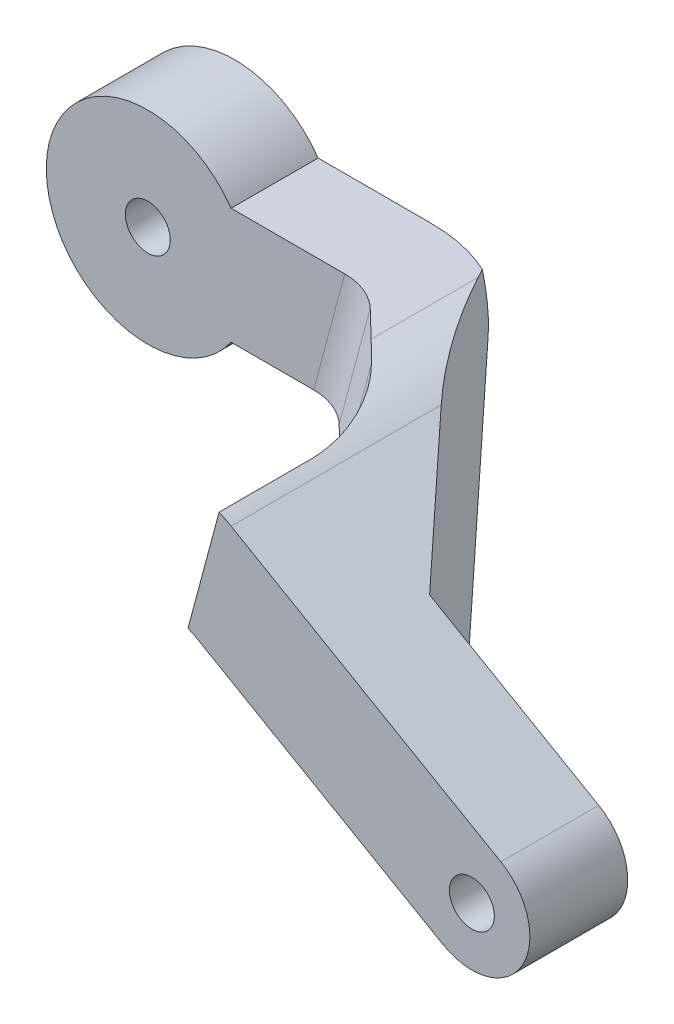
ISO-10303-21;
HEADER;
FILE_DESCRIPTION(('STEP AP214'),'2;1');
FILE_NAME('part.step','',(''),(''),'','','');
FILE_SCHEMA(('AUTOMOTIVE_DESIGN { 1 0 10303 214 1 1 1 1 }'));
ENDSEC;
DATA;
#1=APPLICATION_CONTEXT('core data for automotive mechanical design processes');
#2=APPLICATION_PROTOCOL_DEFINITION('international standard','automotive_design',2000,#1);
#3=PRODUCT_CONTEXT('',#1,'mechanical');
#4=PRODUCT('Part','Part','',(#3));
#5=PRODUCT_RELATED_PRODUCT_CATEGORY('part','',(#4));
#6=PRODUCT_DEFINITION_FORMATION('','',#4);
#7=PRODUCT_DEFINITION_CONTEXT('part definition',#1,'design');
#8=PRODUCT_DEFINITION('design','',#6,#7);
#9=PRODUCT_DEFINITION_SHAPE('','',#8);
#10=(LENGTH_UNIT() NAMED_UNIT(*) SI_UNIT(.MILLI.,.METRE.));
#11=(NAMED_UNIT(*) PLANE_ANGLE_UNIT() SI_UNIT($,.RADIAN.));
#12=(NAMED_UNIT(*) SI_UNIT($,.STERADIAN.) SOLID_ANGLE_UNIT());
#13=UNCERTAINTY_MEASURE_WITH_UNIT(LENGTH_MEASURE(1.E-05),#10,'distance_accuracy_value','');
#14=(GEOMETRIC_REPRESENTATION_CONTEXT(3) GLOBAL_UNCERTAINTY_ASSIGNED_CONTEXT((#13)) GLOBAL_UNIT_ASSIGNED_CONTEXT((#10,
#11,#12)) REPRESENTATION_CONTEXT('',''));
#15=CARTESIAN_POINT('',(0.,0.,0.));
#16=DIRECTION('',(0.,0.,1.));
#17=DIRECTION('',(1.,0.,0.));
#18=AXIS2_PLACEMENT_3D('',#15,#16,#17);
#19=CARTESIAN_POINT('',(0.,0.,-25.35));
#20=DIRECTION('',(0.,0.,1.));
#21=DIRECTION('',(1.,0.,0.));
#22=AXIS2_PLACEMENT_3D('',#19,#20,#21);
#23=PLANE('',#22);
#24=CARTESIAN_POINT('',(40.,-11.5470053837925,-25.35));
#25=DIRECTION('',(0.,0.,1.));
#26=DIRECTION('',(1.,0.,0.));
#27=AXIS2_PLACEMENT_3D('',#24,#25,#26);
#28=CIRCLE('',#27,1.55);
#29=CARTESIAN_POINT('',(41.55,-11.5470053837925,-25.35));
#30=VERTEX_POINT('',#29);
#31=EDGE_CURVE('E181',#30,#30,#28,.F.);
#32=ORIENTED_EDGE('',*,*,#31,.T.);
#33=EDGE_LOOP('',(#32));
#34=FACE_BOUND('',#33,.T.);
#35=DIRECTION('',(-0.866025403784438,0.500000000000001,0.));
#36=VECTOR('',#35,1.);
#37=CARTESIAN_POINT('',(7.00000000000003,12.1243556529822,-25.35));
#38=LINE('',#37,#36);
#39=CARTESIAN_POINT('',(42.,-8.0829037686548,-25.35));
#40=VERTEX_POINT('',#39);
#41=CARTESIAN_POINT('',(23.3923048454133,2.66025403784438,-25.35));
#42=VERTEX_POINT('',#41);
#43=EDGE_CURVE('E172',#40,#42,#38,.T.);
#44=ORIENTED_EDGE('',*,*,#43,.T.);
#45=CARTESIAN_POINT('',(18.3923048454133,-6.,-25.35));
#46=DIRECTION('',(0.,0.,1.));
#47=DIRECTION('',(1.,0.,0.));
#48=AXIS2_PLACEMENT_3D('',#45,#46,#47);
#49=CIRCLE('',#48,10.);
#50=CARTESIAN_POINT('',(22.5678321839119,3.08652691876553,-25.35));
#51=VERTEX_POINT('',#50);
#52=EDGE_CURVE('E218',#42,#51,#49,.T.);
#53=ORIENTED_EDGE('',*,*,#52,.T.);
#54=DIRECTION('',(-0.258819045102521,-0.965925826289068,0.));
#55=VECTOR('',#54,1.);
#56=CARTESIAN_POINT('',(17.8819508450437,-14.4014203161296,-25.35));
#57=LINE('',#56,#55);
#58=CARTESIAN_POINT('',(20.4242386444629,-4.91347308123447,-25.35));
#59=VERTEX_POINT('',#58);
#60=EDGE_CURVE('E184',#51,#59,#57,.T.);
#61=ORIENTED_EDGE('',*,*,#60,.T.);
#62=CARTESIAN_POINT('',(16.2487113059643,-14.,-25.35));
#63=DIRECTION('',(0.,0.,1.));
#64=DIRECTION('',(1.,0.,0.));
#65=AXIS2_PLACEMENT_3D('',#62,#63,#64);
#66=CIRCLE('',#65,10.);
#67=CARTESIAN_POINT('',(21.2487113059643,-5.33974596215562,-25.35));
#68=VERTEX_POINT('',#67);
#69=EDGE_CURVE('E235',#59,#68,#66,.F.);
#70=ORIENTED_EDGE('',*,*,#69,.T.);
#71=DIRECTION('',(-0.866025403784438,0.500000000000001,0.));
#72=VECTOR('',#71,1.);
#73=CARTESIAN_POINT('',(3.00000000000002,5.19615242270665,-25.35));
#74=LINE('',#73,#72);
#75=CARTESIAN_POINT('',(38.,-15.0111069989303,-25.35));
#76=VERTEX_POINT('',#75);
#77=EDGE_CURVE('E174',#76,#68,#74,.T.);
#78=ORIENTED_EDGE('',*,*,#77,.F.);
#79=CARTESIAN_POINT('',(40.,-11.5470053837925,-25.35));
#80=DIRECTION('',(0.,0.,1.));
#81=DIRECTION('',(1.,0.,0.));
#82=AXIS2_PLACEMENT_3D('',#79,#80,#81);
#83=CIRCLE('',#82,4.);
#84=EDGE_CURVE('E162',#40,#76,#83,.F.);
#85=ORIENTED_EDGE('',*,*,#84,.F.);
#86=EDGE_LOOP('',(#44,#53,#61,#70,#78,#85));
#87=FACE_BOUND('',#86,.T.);
#88=ADVANCED_FACE('F40',(#34,#87),#23,.T.);
#89=CARTESIAN_POINT('',(40.,-11.5470053837925,-49.));
#90=DIRECTION('',(0.,0.,1.));
#91=DIRECTION('',(1.,0.,0.));
#92=AXIS2_PLACEMENT_3D('',#89,#90,#91);
#93=CYLINDRICAL_SURFACE('',#92,4.);
#94=DIRECTION('',(0.,0.,1.));
#95=VECTOR('',#94,1.);
#96=CARTESIAN_POINT('',(42.,-8.0829037686548,-49.));
#97=LINE('',#96,#95);
#98=CARTESIAN_POINT('',(42.,-8.0829037686548,-32.1));
#99=VERTEX_POINT('',#98);
#100=EDGE_CURVE('E158',#99,#40,#97,.T.);
#101=ORIENTED_EDGE('',*,*,#100,.T.);
#102=ORIENTED_EDGE('',*,*,#84,.T.);
#103=DIRECTION('',(0.,0.,1.));
#104=VECTOR('',#103,1.);
#105=CARTESIAN_POINT('',(38.,-15.0111069989303,-49.));
#106=LINE('',#105,#104);
#107=CARTESIAN_POINT('',(38.,-15.0111069989303,-32.1));
#108=VERTEX_POINT('',#107);
#109=EDGE_CURVE('E167',#108,#76,#106,.T.);
#110=ORIENTED_EDGE('',*,*,#109,.F.);
#111=CARTESIAN_POINT('',(40.,-11.5470053837925,-32.1));
#112=DIRECTION('',(0.,0.,1.));
#113=DIRECTION('',(1.,0.,0.));
#114=AXIS2_PLACEMENT_3D('',#111,#112,#113);
#115=CIRCLE('',#114,4.);
#116=EDGE_CURVE('E164',#99,#108,#115,.F.);
#117=ORIENTED_EDGE('',*,*,#116,.F.);
#118=EDGE_LOOP('',(#101,#102,#110,#117));
#119=FACE_BOUND('',#118,.T.);
#120=ADVANCED_FACE('F160',(#119),#93,.T.);
#121=CARTESIAN_POINT('',(7.00000000000003,12.1243556529822,-49.));
#122=DIRECTION('',(-0.500000000000001,-0.866025403784438,0.));
#123=DIRECTION('',(0.866025403784438,-0.500000000000001,0.));
#124=AXIS2_PLACEMENT_3D('',#121,#122,#123);
#125=PLANE('',#124);
#126=DIRECTION('',(-0.622892752510496,0.359627298338203,-0.694746590606866));
#127=VECTOR('',#126,1.);
#128=CARTESIAN_POINT('',(10.9496274143465,9.84403720211049,-53.7215187518741));
#129=LINE('',#128,#127);
#130=CARTESIAN_POINT('',(30.3349507982985,-1.34808447194216,-32.1));
#131=VERTEX_POINT('',#130);
#132=CARTESIAN_POINT('',(23.3923048454133,2.66025403784438,-39.8435153742236));
#133=VERTEX_POINT('',#132);
#134=EDGE_CURVE('E201',#131,#133,#129,.T.);
#135=ORIENTED_EDGE('',*,*,#134,.T.);
#136=DIRECTION('',(0.,0.,1.));
#137=VECTOR('',#136,1.);
#138=CARTESIAN_POINT('',(23.3923048454133,2.66025403784438,-49.));
#139=LINE('',#138,#137);
#140=EDGE_CURVE('E180',#133,#42,#139,.T.);
#141=ORIENTED_EDGE('',*,*,#140,.T.);
#142=ORIENTED_EDGE('',*,*,#43,.F.);
#143=ORIENTED_EDGE('',*,*,#100,.F.);
#144=DIRECTION('',(-0.866025403784438,0.500000000000001,0.));
#145=VECTOR('',#144,1.);
#146=CARTESIAN_POINT('',(7.00000000000003,12.1243556529821,-32.1));
#147=LINE('',#146,#145);
#148=EDGE_CURVE('E383',#99,#131,#147,.T.);
#149=ORIENTED_EDGE('',*,*,#148,.T.);
#150=EDGE_LOOP('',(#135,#141,#142,#143,#149));
#151=FACE_BOUND('',#150,.T.);
#152=ADVANCED_FACE('F178',(#151),#125,.F.);
#153=CARTESIAN_POINT('',(3.00000000000002,5.19615242270665,-49.));
#154=DIRECTION('',(-0.500000000000001,-0.866025403784438,0.));
#155=DIRECTION('',(0.866025403784438,-0.500000000000001,0.));
#156=AXIS2_PLACEMENT_3D('',#153,#154,#155);
#157=PLANE('',#156);
#158=ORIENTED_EDGE('',*,*,#77,.T.);
#159=DIRECTION('',(0.,0.,1.));
#160=VECTOR('',#159,1.);
#161=CARTESIAN_POINT('',(21.2487113059643,-5.33974596215562,-45.9071014330082));
#162=LINE('',#161,#160);
#163=CARTESIAN_POINT('',(21.2487113059643,-5.33974596215562,-43.318910981983));
#164=VERTEX_POINT('',#163);
#165=EDGE_CURVE('E215',#68,#164,#162,.F.);
#166=ORIENTED_EDGE('',*,*,#165,.T.);
#167=DIRECTION('',(-0.622892752510496,0.359627298338203,-0.694746590606866));
#168=VECTOR('',#167,1.);
#169=CARTESIAN_POINT('',(9.34965090661684,1.53017976251126,-56.5905883462697));
#170=LINE('',#169,#168);
#171=CARTESIAN_POINT('',(31.3073117168471,-11.1470816170497,-32.1));
#172=VERTEX_POINT('',#171);
#173=EDGE_CURVE('E385',#172,#164,#170,.T.);
#174=ORIENTED_EDGE('',*,*,#173,.F.);
#175=DIRECTION('',(-0.866025403784438,0.500000000000001,0.));
#176=VECTOR('',#175,1.);
#177=CARTESIAN_POINT('',(3.00000000000002,5.19615242270664,-32.1));
#178=LINE('',#177,#176);
#179=EDGE_CURVE('E381',#108,#172,#178,.T.);
#180=ORIENTED_EDGE('',*,*,#179,.F.);
#181=ORIENTED_EDGE('',*,*,#109,.T.);
#182=EDGE_LOOP('',(#158,#166,#174,#180,#181));
#183=FACE_BOUND('',#182,.T.);
#184=ADVANCED_FACE('F303',(#183),#157,.T.);
#185=CARTESIAN_POINT('',(40.,-11.5470053837925,-49.));
#186=DIRECTION('',(0.,0.,1.));
#187=DIRECTION('',(1.,0.,0.));
#188=AXIS2_PLACEMENT_3D('',#185,#186,#187);
#189=CYLINDRICAL_SURFACE('',#188,1.55);
#190=CARTESIAN_POINT('',(40.,-11.5470053837925,-32.1));
#191=DIRECTION('',(0.,0.,1.));
#192=DIRECTION('',(1.,0.,0.));
#193=AXIS2_PLACEMENT_3D('',#190,#191,#192);
#194=CIRCLE('',#193,1.55);
#195=CARTESIAN_POINT('',(41.55,-11.5470053837925,-32.1));
#196=VERTEX_POINT('',#195);
#197=EDGE_CURVE('E378',#196,#196,#194,.F.);
#198=ORIENTED_EDGE('',*,*,#197,.T.);
#199=EDGE_LOOP('',(#198));
#200=FACE_BOUND('',#199,.T.);
#201=ORIENTED_EDGE('',*,*,#31,.F.);
#202=EDGE_LOOP('',(#201));
#203=FACE_BOUND('',#202,.T.);
#204=ADVANCED_FACE('F312',(#200,#203),#189,.F.);
#205=CARTESIAN_POINT('',(17.8819508450437,-14.4014203161296,-35.740336584551));
#206=DIRECTION('',(0.965925826289068,-0.258819045102521,0.));
#207=DIRECTION('',(0.258819045102521,0.965925826289068,0.));
#208=AXIS2_PLACEMENT_3D('',#205,#206,#207);
#209=PLANE('',#208);
#210=DIRECTION('',(0.,0.,1.));
#211=VECTOR('',#210,1.);
#212=CARTESIAN_POINT('',(22.5678321839119,3.08652691876553,-25.35));
#213=LINE('',#212,#211);
#214=CARTESIAN_POINT('',(22.5678321839119,3.08652691876553,-31.59820096082));
#215=VERTEX_POINT('',#214);
#216=EDGE_CURVE('E220',#51,#215,#213,.F.);
#217=ORIENTED_EDGE('',*,*,#216,.T.);
#218=DIRECTION('',(0.258819045102521,0.965925826289068,0.));
#219=VECTOR('',#218,1.);
#220=CARTESIAN_POINT('',(20.4242386444629,-4.91347308123447,-31.59820096082));
#221=LINE('',#220,#219);
#222=CARTESIAN_POINT('',(20.4242386444629,-4.91347308123447,-31.59820096082));
#223=VERTEX_POINT('',#222);
#224=EDGE_CURVE('E330',#215,#223,#221,.F.);
#225=ORIENTED_EDGE('',*,*,#224,.T.);
#226=DIRECTION('',(0.,0.,-1.));
#227=VECTOR('',#226,1.);
#228=CARTESIAN_POINT('',(20.4242386444629,-4.91347308123447,-35.740336584551));
#229=LINE('',#228,#227);
#230=EDGE_CURVE('E233',#223,#59,#229,.F.);
#231=ORIENTED_EDGE('',*,*,#230,.T.);
#232=ORIENTED_EDGE('',*,*,#60,.F.);
#233=EDGE_LOOP('',(#217,#225,#231,#232));
#234=FACE_BOUND('',#233,.T.);
#235=ADVANCED_FACE('F316',(#234),#209,.F.);
#236=CARTESIAN_POINT('',(0.,0.,-49.));
#237=DIRECTION('',(0.,0.,1.));
#238=DIRECTION('',(1.,0.,0.));
#239=AXIS2_PLACEMENT_3D('',#236,#237,#238);
#240=PLANE('',#239);
#241=CARTESIAN_POINT('',(0.,0.,-49.));
#242=DIRECTION('',(0.,0.,-1.));
#243=DIRECTION('',(-1.,0.,0.));
#244=AXIS2_PLACEMENT_3D('',#241,#242,#243);
#245=CIRCLE('',#244,1.55);
#246=CARTESIAN_POINT('',(-1.55,0.,-49.));
#247=VERTEX_POINT('',#246);
#248=EDGE_CURVE('E200',#247,#247,#245,.T.);
#249=ORIENTED_EDGE('',*,*,#248,.F.);
#250=EDGE_LOOP('',(#249));
#251=FACE_BOUND('',#250,.T.);
#252=DIRECTION('',(1.,0.,0.));
#253=VECTOR('',#252,1.);
#254=CARTESIAN_POINT('',(0.,4.,-49.));
#255=LINE('',#254,#253);
#256=CARTESIAN_POINT('',(5.74456264653803,4.,-49.));
#257=VERTEX_POINT('',#256);
#258=CARTESIAN_POINT('',(13.5815382076167,4.,-49.));
#259=VERTEX_POINT('',#258);
#260=EDGE_CURVE('E358',#257,#259,#255,.T.);
#261=ORIENTED_EDGE('',*,*,#260,.T.);
#262=DIRECTION('',(-0.258819045102521,-0.965925826289068,0.));
#263=VECTOR('',#262,1.);
#264=CARTESIAN_POINT('',(11.6717476589409,-3.12743535947305,-49.));
#265=LINE('',#264,#263);
#266=CARTESIAN_POINT('',(11.4379446681677,-4.,-49.));
#267=VERTEX_POINT('',#266);
#268=EDGE_CURVE('E240',#259,#267,#265,.T.);
#269=ORIENTED_EDGE('',*,*,#268,.T.);
#270=DIRECTION('',(1.,0.,0.));
#271=VECTOR('',#270,1.);
#272=CARTESIAN_POINT('',(0.,-4.,-49.));
#273=LINE('',#272,#271);
#274=CARTESIAN_POINT('',(5.74456264653803,-4.,-49.));
#275=VERTEX_POINT('',#274);
#276=EDGE_CURVE('E197',#275,#267,#273,.T.);
#277=ORIENTED_EDGE('',*,*,#276,.F.);
#278=CARTESIAN_POINT('',(0.,0.,-49.));
#279=DIRECTION('',(0.,0.,1.));
#280=DIRECTION('',(1.,0.,0.));
#281=AXIS2_PLACEMENT_3D('',#278,#279,#280);
#282=CIRCLE('',#281,7.);
#283=EDGE_CURVE('E364',#257,#275,#282,.T.);
#284=ORIENTED_EDGE('',*,*,#283,.F.);
#285=EDGE_LOOP('',(#261,#269,#277,#284));
#286=FACE_BOUND('',#285,.T.);
#287=ADVANCED_FACE('F318',(#251,#286),#240,.F.);
#288=CARTESIAN_POINT('',(0.,4.,-49.));
#289=DIRECTION('',(0.,-1.,0.));
#290=DIRECTION('',(0.,0.,-1.));
#291=AXIS2_PLACEMENT_3D('',#288,#289,#290);
#292=PLANE('',#291);
#293=DIRECTION('',(0.475576474947912,0.,0.879674380936559));
#294=VECTOR('',#293,1.);
#295=CARTESIAN_POINT('',(14.0593147284774,4.,-55.4027023387715));
#296=LINE('',#295,#294);
#297=CARTESIAN_POINT('',(18.3923048454133,4.,-47.3879652785811));
#298=VERTEX_POINT('',#297);
#299=CARTESIAN_POINT('',(18.0504129407587,4.,-48.0203631481501));
#300=VERTEX_POINT('',#299);
#301=EDGE_CURVE('E203',#298,#300,#296,.F.);
#302=ORIENTED_EDGE('',*,*,#301,.T.);
#303=CARTESIAN_POINT('',(13.5815382076167,4.,-39.));
#304=DIRECTION('',(0.,-1.,0.));
#305=DIRECTION('',(-1.,0.,0.));
#306=AXIS2_PLACEMENT_3D('',#303,#304,#305);
#307=ELLIPSE('',#306,10.3527618041008,10.);
#308=EDGE_CURVE('E336',#300,#259,#307,.F.);
#309=ORIENTED_EDGE('',*,*,#308,.T.);
#310=ORIENTED_EDGE('',*,*,#260,.F.);
#311=DIRECTION('',(0.,0.,1.));
#312=VECTOR('',#311,1.);
#313=CARTESIAN_POINT('',(5.74456264653803,4.,-49.));
#314=LINE('',#313,#312);
#315=CARTESIAN_POINT('',(5.74456264653803,4.,-43.));
#316=VERTEX_POINT('',#315);
#317=EDGE_CURVE('E168',#257,#316,#314,.T.);
#318=ORIENTED_EDGE('',*,*,#317,.T.);
#319=DIRECTION('',(1.,0.,0.));
#320=VECTOR('',#319,1.);
#321=CARTESIAN_POINT('',(0.,4.,-43.));
#322=LINE('',#321,#320);
#323=CARTESIAN_POINT('',(13.5815382076167,4.,-43.));
#324=VERTEX_POINT('',#323);
#325=EDGE_CURVE('E387',#316,#324,#322,.T.);
#326=ORIENTED_EDGE('',*,*,#325,.T.);
#327=CARTESIAN_POINT('',(13.5815382076167,4.,-39.));
#328=DIRECTION('',(0.,-1.,0.));
#329=DIRECTION('',(-1.,0.,0.));
#330=AXIS2_PLACEMENT_3D('',#327,#328,#329);
#331=ELLIPSE('',#330,4.14110472164033,4.);
#332=CARTESIAN_POINT('',(16.5097414378922,4.,-41.8284271247462));
#333=VERTEX_POINT('',#332);
#334=EDGE_CURVE('E48',#324,#333,#331,.T.);
#335=ORIENTED_EDGE('',*,*,#334,.T.);
#336=DIRECTION('',(0.719254596676404,0.,0.694746590606865));
#337=VECTOR('',#336,1.);
#338=CARTESIAN_POINT('',(4.38517088009313,4.,-53.5398629591883));
#339=LINE('',#338,#337);
#340=CARTESIAN_POINT('',(18.3923048454133,4.,-40.0100105097948));
#341=VERTEX_POINT('',#340);
#342=EDGE_CURVE('E376',#333,#341,#339,.T.);
#343=ORIENTED_EDGE('',*,*,#342,.T.);
#344=DIRECTION('',(0.,0.,1.));
#345=VECTOR('',#344,1.);
#346=CARTESIAN_POINT('',(18.3923048454133,4.,-49.));
#347=LINE('',#346,#345);
#348=EDGE_CURVE('E226',#341,#298,#347,.F.);
#349=ORIENTED_EDGE('',*,*,#348,.T.);
#350=EDGE_LOOP('',(#302,#309,#310,#318,#326,#335,#343,#349));
#351=FACE_BOUND('',#350,.T.);
#352=ADVANCED_FACE('F323',(#351),#292,.F.);
#353=CARTESIAN_POINT('',(0.,0.,-49.));
#354=DIRECTION('',(0.,0.,1.));
#355=DIRECTION('',(1.,0.,0.));
#356=AXIS2_PLACEMENT_3D('',#353,#354,#355);
#357=CYLINDRICAL_SURFACE('',#356,7.);
#358=CARTESIAN_POINT('',(0.,0.,-43.));
#359=DIRECTION('',(0.,0.,-1.));
#360=DIRECTION('',(-1.,0.,0.));
#361=AXIS2_PLACEMENT_3D('',#358,#359,#360);
#362=CIRCLE('',#361,7.);
#363=CARTESIAN_POINT('',(5.74456264653803,-4.,-43.));
#364=VERTEX_POINT('',#363);
#365=EDGE_CURVE('E368',#316,#364,#362,.F.);
#366=ORIENTED_EDGE('',*,*,#365,.F.);
#367=ORIENTED_EDGE('',*,*,#317,.F.);
#368=ORIENTED_EDGE('',*,*,#283,.T.);
#369=DIRECTION('',(0.,0.,1.));
#370=VECTOR('',#369,1.);
#371=CARTESIAN_POINT('',(5.74456264653803,-4.,-49.));
#372=LINE('',#371,#370);
#373=EDGE_CURVE('E191',#275,#364,#372,.T.);
#374=ORIENTED_EDGE('',*,*,#373,.T.);
#375=EDGE_LOOP('',(#366,#367,#368,#374));
#376=FACE_BOUND('',#375,.T.);
#377=ADVANCED_FACE('F398',(#376),#357,.T.);
#378=CARTESIAN_POINT('',(0.,-4.,-49.));
#379=DIRECTION('',(0.,-1.,0.));
#380=DIRECTION('',(1.,0.,0.));
#381=AXIS2_PLACEMENT_3D('',#378,#379,#380);
#382=PLANE('',#381);
#383=ORIENTED_EDGE('',*,*,#276,.T.);
#384=CARTESIAN_POINT('',(11.4379446681677,-4.,-39.));
#385=DIRECTION('',(0.,-1.,0.));
#386=DIRECTION('',(-1.,0.,0.));
#387=AXIS2_PLACEMENT_3D('',#384,#385,#386);
#388=ELLIPSE('',#387,10.3527618041008,10.);
#389=CARTESIAN_POINT('',(16.2487113059643,-4.,-47.8547638736916));
#390=VERTEX_POINT('',#389);
#391=EDGE_CURVE('E243',#267,#390,#388,.T.);
#392=ORIENTED_EDGE('',*,*,#391,.T.);
#393=DIRECTION('',(0.,0.,1.));
#394=VECTOR('',#393,1.);
#395=CARTESIAN_POINT('',(16.2487113059643,-4.,-37.4218200587696));
#396=LINE('',#395,#394);
#397=CARTESIAN_POINT('',(16.2487113059643,-4.,-40.0100105097948));
#398=VERTEX_POINT('',#397);
#399=EDGE_CURVE('E212',#390,#398,#396,.T.);
#400=ORIENTED_EDGE('',*,*,#399,.T.);
#401=DIRECTION('',(0.719254596676404,0.,0.694746590606865));
#402=VECTOR('',#401,1.);
#403=CARTESIAN_POINT('',(3.35051653041286,-4.,-52.4687099560067));
#404=LINE('',#403,#402);
#405=CARTESIAN_POINT('',(14.3661478984432,-4.,-41.8284271247462));
#406=VERTEX_POINT('',#405);
#407=EDGE_CURVE('E374',#406,#398,#404,.T.);
#408=ORIENTED_EDGE('',*,*,#407,.F.);
#409=CARTESIAN_POINT('',(11.4379446681677,-4.,-39.));
#410=DIRECTION('',(0.,-1.,0.));
#411=DIRECTION('',(-1.,0.,0.));
#412=AXIS2_PLACEMENT_3D('',#409,#410,#411);
#413=ELLIPSE('',#412,4.14110472164033,4.);
#414=CARTESIAN_POINT('',(11.4379446681677,-4.,-43.));
#415=VERTEX_POINT('',#414);
#416=EDGE_CURVE('E11',#406,#415,#413,.F.);
#417=ORIENTED_EDGE('',*,*,#416,.T.);
#418=DIRECTION('',(1.,0.,0.));
#419=VECTOR('',#418,1.);
#420=CARTESIAN_POINT('',(0.,-4.,-43.));
#421=LINE('',#420,#419);
#422=EDGE_CURVE('E365',#364,#415,#421,.T.);
#423=ORIENTED_EDGE('',*,*,#422,.F.);
#424=ORIENTED_EDGE('',*,*,#373,.F.);
#425=EDGE_LOOP('',(#383,#392,#400,#408,#417,#423,#424));
#426=FACE_BOUND('',#425,.T.);
#427=ADVANCED_FACE('F394',(#426),#382,.T.);
#428=CARTESIAN_POINT('',(41.6684712197664,-20.774999241283,-32.1));
#429=DIRECTION('',(0.,0.,1.));
#430=DIRECTION('',(1.,0.,0.));
#431=AXIS2_PLACEMENT_3D('',#428,#429,#430);
#432=PLANE('',#431);
#433=ORIENTED_EDGE('',*,*,#179,.T.);
#434=DIRECTION('',(0.258819045102521,0.965925826289068,0.));
#435=VECTOR('',#434,1.);
#436=CARTESIAN_POINT('',(29.5943983911531,-17.5397611775015,-32.1));
#437=LINE('',#436,#435);
#438=CARTESIAN_POINT('',(32.9240579011119,-5.11330271443025,-32.1));
#439=VERTEX_POINT('',#438);
#440=EDGE_CURVE('E204',#172,#439,#437,.T.);
#441=ORIENTED_EDGE('',*,*,#440,.T.);
#442=DIRECTION('',(0.566606029132407,-0.823988839579035,0.));
#443=VECTOR('',#442,1.);
#444=CARTESIAN_POINT('',(43.0434718571733,-19.8294965672253,-32.1));
#445=LINE('',#444,#443);
#446=EDGE_CURVE('E209',#439,#131,#445,.F.);
#447=ORIENTED_EDGE('',*,*,#446,.T.);
#448=ORIENTED_EDGE('',*,*,#148,.F.);
#449=ORIENTED_EDGE('',*,*,#116,.T.);
#450=EDGE_LOOP('',(#433,#441,#447,#448,#449));
#451=FACE_BOUND('',#450,.T.);
#452=ORIENTED_EDGE('',*,*,#197,.F.);
#453=EDGE_LOOP('',(#452));
#454=FACE_BOUND('',#453,.T.);
#455=ADVANCED_FACE('F410',(#451,#454),#432,.F.);
#456=CARTESIAN_POINT('',(29.5943983911531,-17.5397611775015,-32.1));
#457=DIRECTION('',(-0.683012701892219,0.183012701892219,0.707106781186548));
#458=DIRECTION('',(0.719254596676404,0.,0.694746590606865));
#459=AXIS2_PLACEMENT_3D('',#456,#457,#458);
#460=PLANE('',#459);
#461=CARTESIAN_POINT('',(16.2487113059643,-14.,-45.9071014330082));
#462=DIRECTION('',(-0.683012701892219,0.183012701892219,0.707106781186548));
#463=DIRECTION('',(-0.683012701892219,0.18301270189222,-0.707106781186547));
#464=AXIS2_PLACEMENT_3D('',#461,#462,#463);
#465=ELLIPSE('',#464,14.1421356237309,10.);
#466=CARTESIAN_POINT('',(18.6781744564636,-4.299602647295,-46.0710678118655));
#467=VERTEX_POINT('',#466);
#468=EDGE_CURVE('E237',#164,#467,#465,.T.);
#469=ORIENTED_EDGE('',*,*,#468,.T.);
#470=DIRECTION('',(-0.258819045102521,-0.965925826289068,0.));
#471=VECTOR('',#470,1.);
#472=CARTESIAN_POINT('',(16.0993831708363,-13.9237827473719,-46.0710678118655));
#473=LINE('',#472,#471);
#474=CARTESIAN_POINT('',(20.3979411809967,2.11865414582896,-46.0710678118655));
#475=VERTEX_POINT('',#474);
#476=EDGE_CURVE('E253',#467,#475,#473,.F.);
#477=ORIENTED_EDGE('',*,*,#476,.T.);
#478=DIRECTION('',(0.622892752510496,-0.359627298338203,0.694746590606866));
#479=VECTOR('',#478,1.);
#480=CARTESIAN_POINT('',(34.4158068786298,-5.97456438816355,-30.4361702122961));
#481=LINE('',#480,#479);
#482=EDGE_CURVE('E207',#475,#439,#481,.T.);
#483=ORIENTED_EDGE('',*,*,#482,.T.);
#484=ORIENTED_EDGE('',*,*,#440,.F.);
#485=ORIENTED_EDGE('',*,*,#173,.T.);
#486=EDGE_LOOP('',(#469,#477,#483,#484,#485));
#487=FACE_BOUND('',#486,.T.);
#488=ADVANCED_FACE('F346',(#487),#460,.F.);
#489=CARTESIAN_POINT('',(17.8819508450437,-14.4014203161296,-35.740336584551));
#490=DIRECTION('',(0.683012701892219,-0.183012701892219,-0.707106781186548));
#491=DIRECTION('',(-0.719254596676404,0.,-0.694746590606865));
#492=AXIS2_PLACEMENT_3D('',#489,#490,#491);
#493=PLANE('',#492);
#494=ORIENTED_EDGE('',*,*,#342,.F.);
#495=DIRECTION('',(0.258819045102521,0.965925826289068,0.));
#496=VECTOR('',#495,1.);
#497=CARTESIAN_POINT('',(14.2848989046658,-4.30322537284121,-41.8284271247462));
#498=LINE('',#497,#496);
#499=EDGE_CURVE('E55',#333,#406,#498,.F.);
#500=ORIENTED_EDGE('',*,*,#499,.T.);
#501=ORIENTED_EDGE('',*,*,#407,.T.);
#502=CARTESIAN_POINT('',(16.2487113059643,-14.,-37.4218200587696));
#503=DIRECTION('',(0.683012701892219,-0.183012701892219,-0.707106781186548));
#504=DIRECTION('',(-0.68301270189222,0.18301270189222,-0.707106781186547));
#505=AXIS2_PLACEMENT_3D('',#502,#503,#504);
#506=ELLIPSE('',#505,14.1421356237309,10.);
#507=CARTESIAN_POINT('',(17.6117420873147,-4.09332815275022,-38.6692687726855));
#508=VERTEX_POINT('',#507);
#509=EDGE_CURVE('E230',#398,#508,#506,.T.);
#510=ORIENTED_EDGE('',*,*,#509,.T.);
#511=DIRECTION('',(0.258819045102521,0.965925826289068,0.));
#512=VECTOR('',#511,1.);
#513=CARTESIAN_POINT('',(19.7387009399434,3.84459035086855,-38.6692687726855));
#514=LINE('',#513,#512);
#515=CARTESIAN_POINT('',(19.7553356267637,3.90667184724978,-38.6692687726855));
#516=VERTEX_POINT('',#515);
#517=EDGE_CURVE('E335',#508,#516,#514,.T.);
#518=ORIENTED_EDGE('',*,*,#517,.T.);
#519=CARTESIAN_POINT('',(18.3923048454133,-6.,-37.4218200587696));
#520=DIRECTION('',(0.683012701892219,-0.183012701892219,-0.707106781186548));
#521=DIRECTION('',(0.68301270189222,-0.18301270189222,0.707106781186547));
#522=AXIS2_PLACEMENT_3D('',#519,#520,#521);
#523=ELLIPSE('',#522,14.1421356237309,10.);
#524=EDGE_CURVE('E223',#516,#341,#523,.F.);
#525=ORIENTED_EDGE('',*,*,#524,.T.);
#526=EDGE_LOOP('',(#494,#500,#501,#510,#518,#525));
#527=FACE_BOUND('',#526,.T.);
#528=ADVANCED_FACE('F404',(#527),#493,.F.);
#529=CARTESIAN_POINT('',(-9.16397229105025,-7.154487053259,-43.));
#530=DIRECTION('',(0.,0.,-1.));
#531=DIRECTION('',(-1.,0.,0.));
#532=AXIS2_PLACEMENT_3D('',#529,#530,#531);
#533=PLANE('',#532);
#534=CARTESIAN_POINT('',(0.,0.,-43.));
#535=DIRECTION('',(0.,0.,-1.));
#536=DIRECTION('',(-1.,0.,0.));
#537=AXIS2_PLACEMENT_3D('',#534,#535,#536);
#538=CIRCLE('',#537,1.55);
#539=CARTESIAN_POINT('',(-1.55,0.,-43.));
#540=VERTEX_POINT('',#539);
#541=EDGE_CURVE('E190',#540,#540,#538,.T.);
#542=ORIENTED_EDGE('',*,*,#541,.T.);
#543=EDGE_LOOP('',(#542));
#544=FACE_BOUND('',#543,.T.);
#545=ORIENTED_EDGE('',*,*,#422,.T.);
#546=DIRECTION('',(0.258819045102521,0.965925826289068,0.));
#547=VECTOR('',#546,1.);
#548=CARTESIAN_POINT('',(13.6964416365459,4.42882543472767,-43.));
#549=LINE('',#548,#547);
#550=EDGE_CURVE('E277',#415,#324,#549,.T.);
#551=ORIENTED_EDGE('',*,*,#550,.T.);
#552=ORIENTED_EDGE('',*,*,#325,.F.);
#553=ORIENTED_EDGE('',*,*,#365,.T.);
#554=EDGE_LOOP('',(#545,#551,#552,#553));
#555=FACE_BOUND('',#554,.T.);
#556=ADVANCED_FACE('F309',(#544,#555),#533,.F.);
#557=CARTESIAN_POINT('',(0.,0.,-41.));
#558=DIRECTION('',(0.,0.,-1.));
#559=DIRECTION('',(-1.,0.,0.));
#560=AXIS2_PLACEMENT_3D('',#557,#558,#559);
#561=CYLINDRICAL_SURFACE('',#560,1.55);
#562=ORIENTED_EDGE('',*,*,#248,.T.);
#563=EDGE_LOOP('',(#562));
#564=FACE_BOUND('',#563,.T.);
#565=ORIENTED_EDGE('',*,*,#541,.F.);
#566=EDGE_LOOP('',(#565));
#567=FACE_BOUND('',#566,.T.);
#568=ADVANCED_FACE('F308',(#564,#567),#561,.F.);
#569=CARTESIAN_POINT('',(10.9496274143465,9.84403720211049,-53.7215187518741));
#570=DIRECTION('',(-0.752683386898187,-0.51757369100071,0.406921606051309));
#571=DIRECTION('',(-0.622892752510496,0.359627298338203,-0.694746590606866));
#572=AXIS2_PLACEMENT_3D('',#569,#570,#571);
#573=PLANE('',#572);
#574=ORIENTED_EDGE('',*,*,#482,.F.);
#575=CARTESIAN_POINT('',(16.2020509379953,13.779886651654,-39.));
#576=DIRECTION('',(-0.752683386898187,-0.51757369100071,0.406921606051309));
#577=DIRECTION('',(0.36719288687458,-0.843016189094041,-0.393056088559983));
#578=AXIS2_PLACEMENT_3D('',#575,#576,#577);
#579=ELLIPSE('',#578,14.3937374219641,10.);
#580=EDGE_CURVE('E339',#475,#300,#579,.F.);
#581=ORIENTED_EDGE('',*,*,#580,.T.);
#582=ORIENTED_EDGE('',*,*,#301,.F.);
#583=CARTESIAN_POINT('',(18.3923048454133,-6.,-60.107213490126));
#584=DIRECTION('',(-0.752683386898187,-0.51757369100071,0.406921606051309));
#585=DIRECTION('',(0.335298861969855,0.230564235372914,0.913463084381971));
#586=AXIS2_PLACEMENT_3D('',#583,#584,#585);
#587=ELLIPSE('',#586,24.5747580155257,10.);
#588=EDGE_CURVE('E228',#298,#133,#587,.F.);
#589=ORIENTED_EDGE('',*,*,#588,.T.);
#590=ORIENTED_EDGE('',*,*,#134,.F.);
#591=ORIENTED_EDGE('',*,*,#446,.F.);
#592=EDGE_LOOP('',(#574,#581,#582,#589,#590,#591));
#593=FACE_BOUND('',#592,.T.);
#594=ADVANCED_FACE('F263',(#593),#573,.F.);
#595=CARTESIAN_POINT('',(16.2487113059643,-14.,-49.));
#596=DIRECTION('',(0.,0.,-1.));
#597=DIRECTION('',(-1.,0.,0.));
#598=AXIS2_PLACEMENT_3D('',#595,#596,#597);
#599=CYLINDRICAL_SURFACE('',#598,10.);
#600=ORIENTED_EDGE('',*,*,#399,.F.);
#601=CARTESIAN_POINT('',(16.2487113059643,-4.,-47.8547638736916));
#602=CARTESIAN_POINT('',(16.362462070774,-3.99999769162721,-47.7971072834024));
#603=CARTESIAN_POINT('',(16.4750309526795,-4.00194123066487,-47.7371691520582));
#604=CARTESIAN_POINT('',(16.6975278977693,-4.00945724089253,-47.6128162197866));
#605=CARTESIAN_POINT('',(16.8074562693338,-4.01502928615837,-47.5484019450742));
#606=CARTESIAN_POINT('',(17.1309736348382,-4.03666570551525,-47.3497392599495));
#607=CARTESIAN_POINT('',(17.340328530038,-4.05766019984123,-47.2090412014586));
#608=CARTESIAN_POINT('',(17.7456498421365,-4.11056279789412,-46.9114956341841));
#609=CARTESIAN_POINT('',(17.9416186686458,-4.14246893118558,-46.7546510447301));
#610=CARTESIAN_POINT('',(18.2253627845072,-4.19682478858833,-46.5075070269143));
#611=CARTESIAN_POINT('',(18.3186348959151,-4.2161268810556,-46.4227417129094));
#612=CARTESIAN_POINT('',(18.5013197741884,-4.25656617180184,-46.249587668497));
#613=CARTESIAN_POINT('',(18.590732975661,-4.27770316261494,-46.1611993483256));
#614=CARTESIAN_POINT('',(18.6781744564636,-4.299602647295,-46.0710678118655));
#615=B_SPLINE_CURVE_WITH_KNOTS('',3,(#601,#602,#603,#604,#605,#606,#607,#608,#609,#610,#611,
#612,#613,#614),.UNSPECIFIED.,.F.,.F.,(4,2,2,2,2,2,4),(0.,0.382502442465406,0.764959993820165,
1.52306670764451,2.28103659397081,2.66344332648146,3.04580687770647),.UNSPECIFIED.);
#616=EDGE_CURVE('E245',#390,#467,#615,.T.);
#617=ORIENTED_EDGE('',*,*,#616,.T.);
#618=ORIENTED_EDGE('',*,*,#468,.F.);
#619=ORIENTED_EDGE('',*,*,#165,.F.);
#620=ORIENTED_EDGE('',*,*,#69,.F.);
#621=ORIENTED_EDGE('',*,*,#230,.F.);
#622=CARTESIAN_POINT('',(20.4242386444629,-4.91347308123447,-31.59820096082));
#623=CARTESIAN_POINT('',(20.4242375380366,-4.9134772682574,-31.7383428385674));
#624=CARTESIAN_POINT('',(20.4215228311884,-4.91222449472616,-31.8784673077727));
#625=CARTESIAN_POINT('',(20.4106646705753,-4.90724486856308,-32.1584596531837));
#626=CARTESIAN_POINT('',(20.4025212982483,-4.90351805304547,-32.2983275332069));
#627=CARTESIAN_POINT('',(20.3699535437872,-4.88868979970461,-32.717119620982));
#628=CARTESIAN_POINT('',(20.3373915242565,-4.87394050024908,-32.9953332832246));
#629=CARTESIAN_POINT('',(20.2505262201708,-4.83551854422321,-33.548304831259));
#630=CARTESIAN_POINT('',(20.1961756138991,-4.8118264718088,-33.8230538438698));
#631=CARTESIAN_POINT('',(20.065806958593,-4.7569063803341,-34.3665951099764));
#632=CARTESIAN_POINT('',(19.9897892791629,-4.72567848982378,-34.6353874649988));
#633=CARTESIAN_POINT('',(19.8161314085277,-4.6575050296224,-35.1653186106164));
#634=CARTESIAN_POINT('',(19.7184788459969,-4.62055619221675,-35.4264529250324));
#635=CARTESIAN_POINT('',(19.5016814489343,-4.5431809606586,-35.9391690350282));
#636=CARTESIAN_POINT('',(19.382533128603,-4.50275400304348,-36.1907492732766));
#637=CARTESIAN_POINT('',(19.1233440968233,-4.42112287532597,-36.6817995367339));
#638=CARTESIAN_POINT('',(18.9833669075172,-4.37992138997678,-36.9213035167777));
#639=CARTESIAN_POINT('',(18.6826624881647,-4.29948069073337,-37.3871123428943));
#640=CARTESIAN_POINT('',(18.5219480055641,-4.26024029172693,-37.6134251746606));
#641=CARTESIAN_POINT('',(18.2367587097799,-4.19891047464822,-37.9788430152766));
#642=CARTESIAN_POINT('',(18.1178346751059,-4.1754355225153,-38.122073960833));
#643=CARTESIAN_POINT('',(17.8712660000288,-4.13171845895435,-38.4012503760853));
#644=CARTESIAN_POINT('',(17.7436242908452,-4.1114752684495,-38.5371982674579));
#645=CARTESIAN_POINT('',(17.6117420873147,-4.09332815275022,-38.6692687726855));
#646=B_SPLINE_CURVE_WITH_KNOTS('',3,(#622,#623,#624,#625,#626,#627,#628,#629,#630,#631,#632,
#633,#634,#635,#636,#637,#638,#639,#640,#641,#642,#643,#644,#645),.UNSPECIFIED.,.F.,.F.,(4,2,2,
2,2,2,2,2,2,2,2,4),(0.,0.420359112849768,0.840711919843921,1.68111550788947,2.52335430819414,
3.36557874215922,4.20828602826607,5.05113009268045,5.89145449437673,6.73126477847512,
7.29384073642372,7.85622845706993),.UNSPECIFIED.);
#647=EDGE_CURVE('E270',#223,#508,#646,.T.);
#648=ORIENTED_EDGE('',*,*,#647,.T.);
#649=ORIENTED_EDGE('',*,*,#509,.F.);
#650=EDGE_LOOP('',(#600,#617,#618,#619,#620,#621,#648,#649));
#651=FACE_BOUND('',#650,.T.);
#652=ADVANCED_FACE('F258',(#651),#599,.F.);
#653=CARTESIAN_POINT('',(18.3923048454133,-6.,-49.));
#654=DIRECTION('',(0.,0.,1.));
#655=DIRECTION('',(1.,0.,0.));
#656=AXIS2_PLACEMENT_3D('',#653,#654,#655);
#657=CYLINDRICAL_SURFACE('',#656,10.);
#658=ORIENTED_EDGE('',*,*,#588,.F.);
#659=ORIENTED_EDGE('',*,*,#348,.F.);
#660=ORIENTED_EDGE('',*,*,#524,.F.);
#661=CARTESIAN_POINT('',(19.7553356267637,3.90667184724978,-38.6692687726855));
#662=CARTESIAN_POINT('',(19.8512975634877,3.89346823246151,-38.5731617509317));
#663=CARTESIAN_POINT('',(19.9450195270624,3.87915311538863,-38.4750062042231));
#664=CARTESIAN_POINT('',(20.1278625894366,3.84867657911515,-38.2747964607256));
#665=CARTESIAN_POINT('',(20.2169842707143,3.83251539449644,-38.172742760374));
#666=CARTESIAN_POINT('',(20.4771380313626,3.78185430451078,-37.8611924224085));
#667=CARTESIAN_POINT('',(20.6411419412535,3.745150294005,-37.6461228498312));
#668=CARTESIAN_POINT('',(20.9494561000353,3.66882601069454,-37.2031524348642));
#669=CARTESIAN_POINT('',(21.093783256522,3.62920828719665,-36.9752628492399));
#670=CARTESIAN_POINT('',(21.3625797460917,3.54971802296745,-36.5080600088186));
#671=CARTESIAN_POINT('',(21.4870460875039,3.50984544478595,-36.2687450400355));
#672=CARTESIAN_POINT('',(21.71563883535,3.43239070461895,-35.7808255454445));
#673=CARTESIAN_POINT('',(21.8198042256445,3.39480425006184,-35.5322399383726));
#674=CARTESIAN_POINT('',(22.0079671375275,3.32400644026786,-35.0269298905595));
#675=CARTESIAN_POINT('',(22.0919635194586,3.29079533230943,-34.7702049908319));
#676=CARTESIAN_POINT('',(22.239586128638,3.23064352295358,-34.250616782981));
#677=CARTESIAN_POINT('',(22.3032389042558,3.20369466198102,-33.9877619593115));
#678=CARTESIAN_POINT('',(22.4102275591547,3.15749348853515,-33.4573795027781));
#679=CARTESIAN_POINT('',(22.4535716372229,3.13823807061918,-33.1898538009084));
#680=CARTESIAN_POINT('',(22.5137820412617,3.11122032191603,-32.7015975857132));
#681=CARTESIAN_POINT('',(22.5340624986714,3.10199112211869,-32.4813620253605));
#682=CARTESIAN_POINT('',(22.5610798026156,3.08962915086715,-32.0401568506646));
#683=CARTESIAN_POINT('',(22.5678328259062,3.08648909786222,-31.8191884299892));
#684=CARTESIAN_POINT('',(22.5678321839119,3.08652691876553,-31.5982009608201));
#685=B_SPLINE_CURVE_WITH_KNOTS('',3,(#661,#662,#663,#664,#665,#666,#667,#668,#669,#670,#671,
#672,#673,#674,#675,#676,#677,#678,#679,#680,#681,#682,#683,#684),.UNSPECIFIED.,.F.,.F.,(4,2,2,
2,2,2,2,2,2,2,2,4),(0.,0.409277045599384,0.81850214163567,1.63617308886989,2.45313694911894,
3.27022375419691,4.08572570598354,4.90127372717692,5.7157530723421,6.52990332162837,
7.19349826611084,7.85629917698064),.UNSPECIFIED.);
#686=EDGE_CURVE('E278',#516,#215,#685,.T.);
#687=ORIENTED_EDGE('',*,*,#686,.T.);
#688=ORIENTED_EDGE('',*,*,#216,.F.);
#689=ORIENTED_EDGE('',*,*,#52,.F.);
#690=ORIENTED_EDGE('',*,*,#140,.F.);
#691=EDGE_LOOP('',(#658,#659,#660,#687,#688,#689,#690));
#692=FACE_BOUND('',#691,.T.);
#693=ADVANCED_FACE('F262',(#692),#657,.T.);
#694=CARTESIAN_POINT('',(11.6717476589409,-3.12743535947305,-39.));
#695=DIRECTION('',(-0.258819045102521,-0.965925826289068,0.));
#696=DIRECTION('',(0.965925826289068,-0.258819045102521,0.));
#697=AXIS2_PLACEMENT_3D('',#694,#695,#696);
#698=CYLINDRICAL_SURFACE('',#697,10.);
#699=ORIENTED_EDGE('',*,*,#580,.F.);
#700=ORIENTED_EDGE('',*,*,#476,.F.);
#701=ORIENTED_EDGE('',*,*,#616,.F.);
#702=ORIENTED_EDGE('',*,*,#391,.F.);
#703=ORIENTED_EDGE('',*,*,#268,.F.);
#704=ORIENTED_EDGE('',*,*,#308,.F.);
#705=EDGE_LOOP('',(#699,#700,#701,#702,#703,#704));
#706=FACE_BOUND('',#705,.T.);
#707=ADVANCED_FACE('F255',(#706),#698,.T.);
#708=CARTESIAN_POINT('',(8.22269258215297,-11.8132298651044,-31.59820096082));
#709=DIRECTION('',(-0.258819045102521,-0.965925826289068,0.));
#710=DIRECTION('',(0.965925826289068,-0.258819045102521,0.));
#711=AXIS2_PLACEMENT_3D('',#708,#709,#710);
#712=CYLINDRICAL_SURFACE('',#711,10.);
#713=ORIENTED_EDGE('',*,*,#647,.F.);
#714=ORIENTED_EDGE('',*,*,#224,.F.);
#715=ORIENTED_EDGE('',*,*,#686,.F.);
#716=ORIENTED_EDGE('',*,*,#517,.F.);
#717=EDGE_LOOP('',(#713,#714,#715,#716));
#718=FACE_BOUND('',#717,.T.);
#719=ADVANCED_FACE('F285',(#718),#712,.F.);
#720=CARTESIAN_POINT('',(9.26925615191407,-12.0936557284497,-39.));
#721=DIRECTION('',(-0.258819045102521,-0.965925826289068,0.));
#722=DIRECTION('',(0.965925826289068,-0.258819045102521,0.));
#723=AXIS2_PLACEMENT_3D('',#720,#721,#722);
#724=CYLINDRICAL_SURFACE('',#723,4.);
#725=ORIENTED_EDGE('',*,*,#416,.F.);
#726=ORIENTED_EDGE('',*,*,#499,.F.);
#727=ORIENTED_EDGE('',*,*,#334,.F.);
#728=ORIENTED_EDGE('',*,*,#550,.F.);
#729=EDGE_LOOP('',(#725,#726,#727,#728));
#730=FACE_BOUND('',#729,.T.);
#731=ADVANCED_FACE('F42',(#730),#724,.F.);
#732=CLOSED_SHELL('',(#88,#120,#152,#184,#204,#235,#287,#352,#377,#427,#455,#488,#528,#556,#568,
#594,#652,#693,#707,#719,#731));
#733=MANIFOLD_SOLID_BREP('B2',#732);
#734=ADVANCED_BREP_SHAPE_REPRESENTATION('',(#18,#733),#14);
#735=SHAPE_DEFINITION_REPRESENTATION(#9,#734);
ENDSEC;
END-ISO-10303-21;
